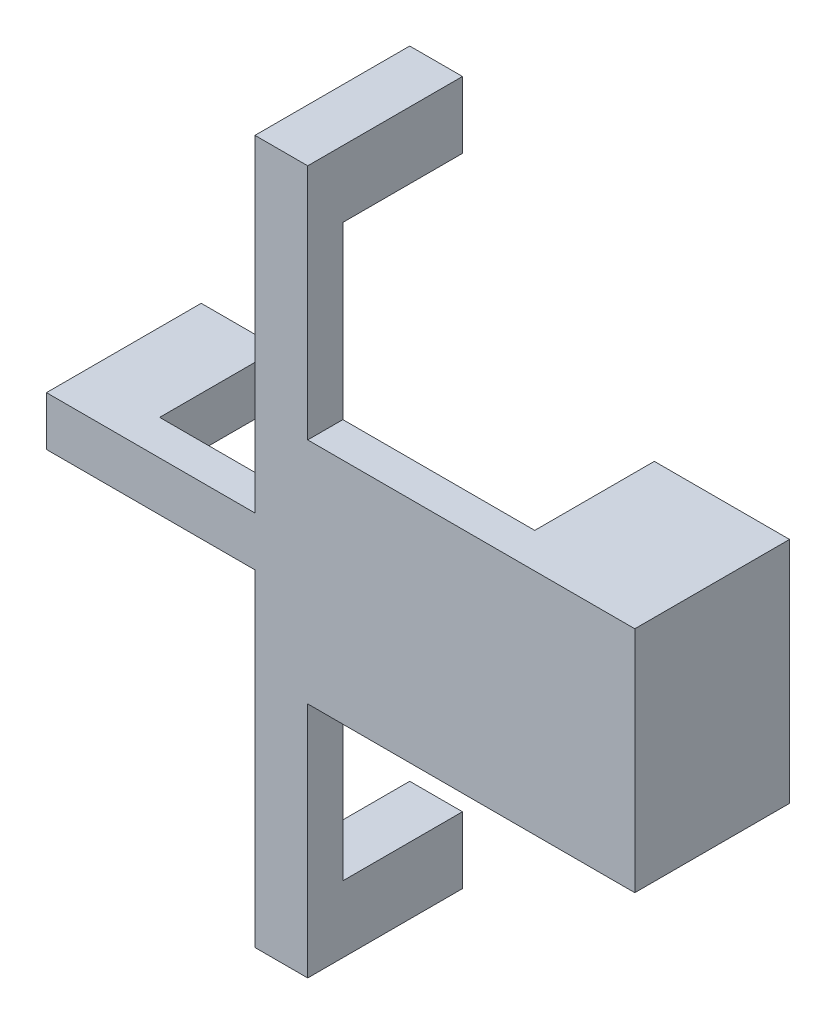
ISO-10303-21;
HEADER;
FILE_DESCRIPTION(('STEP AP214'),'2;1');
FILE_NAME('part.step','',(''),(''),'','','');
FILE_SCHEMA(('AUTOMOTIVE_DESIGN { 1 0 10303 214 1 1 1 1 }'));
ENDSEC;
DATA;
#1=APPLICATION_CONTEXT('core data for automotive mechanical design processes');
#2=APPLICATION_PROTOCOL_DEFINITION('international standard','automotive_design',2000,#1);
#3=PRODUCT_CONTEXT('',#1,'mechanical');
#4=PRODUCT('Part','Part','',(#3));
#5=PRODUCT_RELATED_PRODUCT_CATEGORY('part','',(#4));
#6=PRODUCT_DEFINITION_FORMATION('','',#4);
#7=PRODUCT_DEFINITION_CONTEXT('part definition',#1,'design');
#8=PRODUCT_DEFINITION('design','',#6,#7);
#9=PRODUCT_DEFINITION_SHAPE('','',#8);
#10=(LENGTH_UNIT() NAMED_UNIT(*) SI_UNIT(.MILLI.,.METRE.));
#11=(NAMED_UNIT(*) PLANE_ANGLE_UNIT() SI_UNIT($,.RADIAN.));
#12=(NAMED_UNIT(*) SI_UNIT($,.STERADIAN.) SOLID_ANGLE_UNIT());
#13=UNCERTAINTY_MEASURE_WITH_UNIT(LENGTH_MEASURE(1.E-05),#10,'distance_accuracy_value','');
#14=(GEOMETRIC_REPRESENTATION_CONTEXT(3) GLOBAL_UNCERTAINTY_ASSIGNED_CONTEXT((#13)) GLOBAL_UNIT_ASSIGNED_CONTEXT((#10,
#11,#12)) REPRESENTATION_CONTEXT('',''));
#15=CARTESIAN_POINT('',(0.,0.,0.));
#16=DIRECTION('',(0.,0.,1.));
#17=DIRECTION('',(1.,0.,0.));
#18=AXIS2_PLACEMENT_3D('',#15,#16,#17);
#19=CARTESIAN_POINT('',(-10.4210295985664,-7.9,-8.8));
#20=DIRECTION('',(1.,0.,0.));
#21=DIRECTION('',(0.,0.,-1.));
#22=AXIS2_PLACEMENT_3D('',#19,#20,#21);
#23=PLANE('',#22);
#24=DIRECTION('',(0.,0.,1.));
#25=VECTOR('',#24,1.);
#26=CARTESIAN_POINT('',(-10.4210295985664,-5.10000000000001,-8.8));
#27=LINE('',#26,#25);
#28=CARTESIAN_POINT('',(-10.4210295985664,-5.10000000000001,-8.8));
#29=VERTEX_POINT('',#28);
#30=CARTESIAN_POINT('',(-10.4210295985664,-5.10000000000001,-2.));
#31=VERTEX_POINT('',#30);
#32=EDGE_CURVE('E44',#29,#31,#27,.T.);
#33=ORIENTED_EDGE('',*,*,#32,.T.);
#34=DIRECTION('',(0.,-1.,0.));
#35=VECTOR('',#34,1.);
#36=CARTESIAN_POINT('',(-10.4210295985664,-7.9,-2.));
#37=LINE('',#36,#35);
#38=CARTESIAN_POINT('',(-10.4210295985664,-7.9,-2.));
#39=VERTEX_POINT('',#38);
#40=EDGE_CURVE('E317',#31,#39,#37,.T.);
#41=ORIENTED_EDGE('',*,*,#40,.T.);
#42=DIRECTION('',(0.,0.,1.));
#43=VECTOR('',#42,1.);
#44=CARTESIAN_POINT('',(-10.4210295985664,-7.9,-8.8));
#45=LINE('',#44,#43);
#46=CARTESIAN_POINT('',(-10.4210295985664,-7.9,-8.8));
#47=VERTEX_POINT('',#46);
#48=EDGE_CURVE('E337',#47,#39,#45,.T.);
#49=ORIENTED_EDGE('',*,*,#48,.F.);
#50=DIRECTION('',(0.,1.,0.));
#51=VECTOR('',#50,1.);
#52=CARTESIAN_POINT('',(-10.4210295985664,-7.9,-8.8));
#53=LINE('',#52,#51);
#54=EDGE_CURVE('E325',#47,#29,#53,.T.);
#55=ORIENTED_EDGE('',*,*,#54,.T.);
#56=EDGE_LOOP('',(#33,#41,#49,#55));
#57=FACE_BOUND('',#56,.T.);
#58=ADVANCED_FACE('F35',(#57),#23,.T.);
#59=CARTESIAN_POINT('',(-14.8576651397661,-7.9,-8.8));
#60=DIRECTION('',(-1.,0.,0.));
#61=DIRECTION('',(0.,0.,1.));
#62=AXIS2_PLACEMENT_3D('',#59,#60,#61);
#63=PLANE('',#62);
#64=DIRECTION('',(0.,-1.,0.));
#65=VECTOR('',#64,1.);
#66=CARTESIAN_POINT('',(-14.8576651397661,-7.9,0.));
#67=LINE('',#66,#65);
#68=CARTESIAN_POINT('',(-14.8576651397661,-5.10000000000001,0.));
#69=VERTEX_POINT('',#68);
#70=CARTESIAN_POINT('',(-14.8576651397661,-7.9,0.));
#71=VERTEX_POINT('',#70);
#72=EDGE_CURVE('E319',#69,#71,#67,.T.);
#73=ORIENTED_EDGE('',*,*,#72,.F.);
#74=DIRECTION('',(0.,0.,1.));
#75=VECTOR('',#74,1.);
#76=CARTESIAN_POINT('',(-14.8576651397661,-5.10000000000001,-8.8));
#77=LINE('',#76,#75);
#78=CARTESIAN_POINT('',(-14.8576651397661,-5.10000000000001,-8.8));
#79=VERTEX_POINT('',#78);
#80=EDGE_CURVE('E11',#79,#69,#77,.T.);
#81=ORIENTED_EDGE('',*,*,#80,.F.);
#82=DIRECTION('',(0.,-1.,0.));
#83=VECTOR('',#82,1.);
#84=CARTESIAN_POINT('',(-14.8576651397661,-7.9,-8.8));
#85=LINE('',#84,#83);
#86=CARTESIAN_POINT('',(-14.8576651397661,-7.9,-8.8));
#87=VERTEX_POINT('',#86);
#88=EDGE_CURVE('E320',#79,#87,#85,.T.);
#89=ORIENTED_EDGE('',*,*,#88,.T.);
#90=DIRECTION('',(0.,0.,1.));
#91=VECTOR('',#90,1.);
#92=CARTESIAN_POINT('',(-14.8576651397661,-7.9,-8.8));
#93=LINE('',#92,#91);
#94=EDGE_CURVE('E39',#87,#71,#93,.T.);
#95=ORIENTED_EDGE('',*,*,#94,.T.);
#96=EDGE_LOOP('',(#73,#81,#89,#95));
#97=FACE_BOUND('',#96,.T.);
#98=ADVANCED_FACE('F37',(#97),#63,.T.);
#99=CARTESIAN_POINT('',(-14.8576651397661,-5.10000000000001,-8.8));
#100=DIRECTION('',(0.,1.,0.));
#101=DIRECTION('',(0.,0.,1.));
#102=AXIS2_PLACEMENT_3D('',#99,#100,#101);
#103=PLANE('',#102);
#104=DIRECTION('',(-1.,0.,0.));
#105=VECTOR('',#104,1.);
#106=CARTESIAN_POINT('',(-14.8576651397661,-5.10000000000001,-2.));
#107=LINE('',#106,#105);
#108=CARTESIAN_POINT('',(-3.,-5.10000000000001,-2.));
#109=VERTEX_POINT('',#108);
#110=EDGE_CURVE('E243',#109,#31,#107,.T.);
#111=ORIENTED_EDGE('',*,*,#110,.T.);
#112=ORIENTED_EDGE('',*,*,#32,.F.);
#113=DIRECTION('',(-1.,0.,0.));
#114=VECTOR('',#113,1.);
#115=CARTESIAN_POINT('',(-14.8576651397661,-5.10000000000001,-8.8));
#116=LINE('',#115,#114);
#117=EDGE_CURVE('E328',#29,#79,#116,.T.);
#118=ORIENTED_EDGE('',*,*,#117,.T.);
#119=ORIENTED_EDGE('',*,*,#80,.T.);
#120=DIRECTION('',(-1.,0.,0.));
#121=VECTOR('',#120,1.);
#122=CARTESIAN_POINT('',(-14.8576651397661,-5.10000000000001,0.));
#123=LINE('',#122,#121);
#124=CARTESIAN_POINT('',(-3.,-5.10000000000001,0.));
#125=VERTEX_POINT('',#124);
#126=EDGE_CURVE('E323',#125,#69,#123,.T.);
#127=ORIENTED_EDGE('',*,*,#126,.F.);
#128=DIRECTION('',(0.,0.,1.));
#129=VECTOR('',#128,1.);
#130=CARTESIAN_POINT('',(-3.,-5.10000000000001,-2.));
#131=LINE('',#130,#129);
#132=EDGE_CURVE('E266',#109,#125,#131,.T.);
#133=ORIENTED_EDGE('',*,*,#132,.F.);
#134=EDGE_LOOP('',(#111,#112,#118,#119,#127,#133));
#135=FACE_BOUND('',#134,.T.);
#136=ADVANCED_FACE('F345',(#135),#103,.T.);
#137=CARTESIAN_POINT('',(-14.8576651397661,-7.9,-8.8));
#138=DIRECTION('',(0.,-1.,0.));
#139=DIRECTION('',(0.,0.,-1.));
#140=AXIS2_PLACEMENT_3D('',#137,#138,#139);
#141=PLANE('',#140);
#142=DIRECTION('',(1.,0.,0.));
#143=VECTOR('',#142,1.);
#144=CARTESIAN_POINT('',(-14.8576651397661,-7.9,0.));
#145=LINE('',#144,#143);
#146=CARTESIAN_POINT('',(-3.,-7.9,0.));
#147=VERTEX_POINT('',#146);
#148=EDGE_CURVE('E332',#71,#147,#145,.T.);
#149=ORIENTED_EDGE('',*,*,#148,.F.);
#150=ORIENTED_EDGE('',*,*,#94,.F.);
#151=DIRECTION('',(1.,0.,0.));
#152=VECTOR('',#151,1.);
#153=CARTESIAN_POINT('',(-14.8576651397661,-7.9,-8.8));
#154=LINE('',#153,#152);
#155=EDGE_CURVE('E322',#87,#47,#154,.T.);
#156=ORIENTED_EDGE('',*,*,#155,.T.);
#157=ORIENTED_EDGE('',*,*,#48,.T.);
#158=DIRECTION('',(1.,0.,0.));
#159=VECTOR('',#158,1.);
#160=CARTESIAN_POINT('',(-14.8576651397661,-7.9,-2.));
#161=LINE('',#160,#159);
#162=CARTESIAN_POINT('',(-3.,-7.9,-2.));
#163=VERTEX_POINT('',#162);
#164=EDGE_CURVE('E52',#39,#163,#161,.T.);
#165=ORIENTED_EDGE('',*,*,#164,.T.);
#166=DIRECTION('',(0.,0.,1.));
#167=VECTOR('',#166,1.);
#168=CARTESIAN_POINT('',(-3.,-7.9,-2.));
#169=LINE('',#168,#167);
#170=EDGE_CURVE('E190',#163,#147,#169,.T.);
#171=ORIENTED_EDGE('',*,*,#170,.T.);
#172=EDGE_LOOP('',(#149,#150,#156,#157,#165,#171));
#173=FACE_BOUND('',#172,.T.);
#174=ADVANCED_FACE('F339',(#173),#141,.T.);
#175=CARTESIAN_POINT('',(0.,0.,-8.8));
#176=DIRECTION('',(0.,0.,-1.));
#177=DIRECTION('',(-1.,0.,0.));
#178=AXIS2_PLACEMENT_3D('',#175,#176,#177);
#179=PLANE('',#178);
#180=ORIENTED_EDGE('',*,*,#88,.F.);
#181=ORIENTED_EDGE('',*,*,#117,.F.);
#182=ORIENTED_EDGE('',*,*,#54,.F.);
#183=ORIENTED_EDGE('',*,*,#155,.F.);
#184=EDGE_LOOP('',(#180,#181,#182,#183));
#185=FACE_BOUND('',#184,.T.);
#186=ADVANCED_FACE('F354',(#185),#179,.T.);
#187=CARTESIAN_POINT('',(0.,0.,0.));
#188=DIRECTION('',(0.,0.,-1.));
#189=DIRECTION('',(-1.,0.,0.));
#190=AXIS2_PLACEMENT_3D('',#187,#188,#189);
#191=PLANE('',#190);
#192=ORIENTED_EDGE('',*,*,#72,.T.);
#193=ORIENTED_EDGE('',*,*,#148,.T.);
#194=DIRECTION('',(0.,-1.,0.));
#195=VECTOR('',#194,1.);
#196=CARTESIAN_POINT('',(-3.,-7.9,0.));
#197=LINE('',#196,#195);
#198=CARTESIAN_POINT('',(-3.,-26.5,0.));
#199=VERTEX_POINT('',#198);
#200=EDGE_CURVE('E259',#147,#199,#197,.T.);
#201=ORIENTED_EDGE('',*,*,#200,.T.);
#202=DIRECTION('',(1.,0.,0.));
#203=VECTOR('',#202,1.);
#204=CARTESIAN_POINT('',(-3.,-26.5,0.));
#205=LINE('',#204,#203);
#206=CARTESIAN_POINT('',(0.,-26.5,0.));
#207=VERTEX_POINT('',#206);
#208=EDGE_CURVE('E185',#199,#207,#205,.T.);
#209=ORIENTED_EDGE('',*,*,#208,.T.);
#210=DIRECTION('',(0.,1.,0.));
#211=VECTOR('',#210,1.);
#212=CARTESIAN_POINT('',(0.,-13.,0.));
#213=LINE('',#212,#211);
#214=CARTESIAN_POINT('',(0.,-13.,0.));
#215=VERTEX_POINT('',#214);
#216=EDGE_CURVE('E229',#207,#215,#213,.T.);
#217=ORIENTED_EDGE('',*,*,#216,.T.);
#218=DIRECTION('',(1.,0.,0.));
#219=VECTOR('',#218,1.);
#220=CARTESIAN_POINT('',(10.9105999006382,-13.,0.));
#221=LINE('',#220,#219);
#222=CARTESIAN_POINT('',(18.6,-13.,0.));
#223=VERTEX_POINT('',#222);
#224=EDGE_CURVE('E286',#215,#223,#221,.T.);
#225=ORIENTED_EDGE('',*,*,#224,.T.);
#226=DIRECTION('',(0.,1.,0.));
#227=VECTOR('',#226,1.);
#228=CARTESIAN_POINT('',(18.6,0.,0.));
#229=LINE('',#228,#227);
#230=CARTESIAN_POINT('',(18.6,0.,0.));
#231=VERTEX_POINT('',#230);
#232=EDGE_CURVE('E281',#223,#231,#229,.T.);
#233=ORIENTED_EDGE('',*,*,#232,.T.);
#234=DIRECTION('',(-1.,0.,0.));
#235=VECTOR('',#234,1.);
#236=CARTESIAN_POINT('',(10.9105999006382,0.,0.));
#237=LINE('',#236,#235);
#238=CARTESIAN_POINT('',(0.,0.,0.));
#239=VERTEX_POINT('',#238);
#240=EDGE_CURVE('E298',#231,#239,#237,.T.);
#241=ORIENTED_EDGE('',*,*,#240,.T.);
#242=DIRECTION('',(0.,1.,0.));
#243=VECTOR('',#242,1.);
#244=CARTESIAN_POINT('',(0.,0.,0.));
#245=LINE('',#244,#243);
#246=CARTESIAN_POINT('',(0.,13.5,0.));
#247=VERTEX_POINT('',#246);
#248=EDGE_CURVE('E251',#239,#247,#245,.T.);
#249=ORIENTED_EDGE('',*,*,#248,.T.);
#250=DIRECTION('',(-1.,0.,0.));
#251=VECTOR('',#250,1.);
#252=CARTESIAN_POINT('',(0.,13.5,0.));
#253=LINE('',#252,#251);
#254=CARTESIAN_POINT('',(-3.,13.5,0.));
#255=VERTEX_POINT('',#254);
#256=EDGE_CURVE('E253',#247,#255,#253,.T.);
#257=ORIENTED_EDGE('',*,*,#256,.T.);
#258=DIRECTION('',(0.,-1.,0.));
#259=VECTOR('',#258,1.);
#260=CARTESIAN_POINT('',(-3.,-5.10000000000001,0.));
#261=LINE('',#260,#259);
#262=EDGE_CURVE('E256',#255,#125,#261,.T.);
#263=ORIENTED_EDGE('',*,*,#262,.T.);
#264=ORIENTED_EDGE('',*,*,#126,.T.);
#265=EDGE_LOOP('',(#192,#193,#201,#209,#217,#225,#233,#241,#249,#257,#263,#264));
#266=FACE_BOUND('',#265,.T.);
#267=ADVANCED_FACE('F342',(#266),#191,.F.);
#268=CARTESIAN_POINT('',(10.9105999006382,0.,-8.8));
#269=DIRECTION('',(-1.,0.,0.));
#270=DIRECTION('',(0.,0.,1.));
#271=AXIS2_PLACEMENT_3D('',#268,#269,#270);
#272=PLANE('',#271);
#273=DIRECTION('',(0.,0.,1.));
#274=VECTOR('',#273,1.);
#275=CARTESIAN_POINT('',(10.9105999006382,-13.,-8.8));
#276=LINE('',#275,#274);
#277=CARTESIAN_POINT('',(10.9105999006382,-13.,-8.8));
#278=VERTEX_POINT('',#277);
#279=CARTESIAN_POINT('',(10.9105999006382,-13.,-2.));
#280=VERTEX_POINT('',#279);
#281=EDGE_CURVE('E305',#278,#280,#276,.T.);
#282=ORIENTED_EDGE('',*,*,#281,.T.);
#283=DIRECTION('',(0.,1.,0.));
#284=VECTOR('',#283,1.);
#285=CARTESIAN_POINT('',(10.9105999006382,0.,-2.));
#286=LINE('',#285,#284);
#287=CARTESIAN_POINT('',(10.9105999006382,0.,-2.));
#288=VERTEX_POINT('',#287);
#289=EDGE_CURVE('E262',#280,#288,#286,.T.);
#290=ORIENTED_EDGE('',*,*,#289,.T.);
#291=DIRECTION('',(0.,0.,1.));
#292=VECTOR('',#291,1.);
#293=CARTESIAN_POINT('',(10.9105999006382,0.,-8.8));
#294=LINE('',#293,#292);
#295=CARTESIAN_POINT('',(10.9105999006382,0.,-8.8));
#296=VERTEX_POINT('',#295);
#297=EDGE_CURVE('E308',#296,#288,#294,.T.);
#298=ORIENTED_EDGE('',*,*,#297,.F.);
#299=DIRECTION('',(0.,-1.,0.));
#300=VECTOR('',#299,1.);
#301=CARTESIAN_POINT('',(10.9105999006382,0.,-8.8));
#302=LINE('',#301,#300);
#303=EDGE_CURVE('E289',#296,#278,#302,.T.);
#304=ORIENTED_EDGE('',*,*,#303,.T.);
#305=EDGE_LOOP('',(#282,#290,#298,#304));
#306=FACE_BOUND('',#305,.T.);
#307=ADVANCED_FACE('F361',(#306),#272,.T.);
#308=CARTESIAN_POINT('',(18.6,0.,-8.8));
#309=DIRECTION('',(1.,0.,0.));
#310=DIRECTION('',(0.,1.,0.));
#311=AXIS2_PLACEMENT_3D('',#308,#309,#310);
#312=PLANE('',#311);
#313=ORIENTED_EDGE('',*,*,#232,.F.);
#314=DIRECTION('',(0.,0.,1.));
#315=VECTOR('',#314,1.);
#316=CARTESIAN_POINT('',(18.6,-13.,-8.8));
#317=LINE('',#316,#315);
#318=CARTESIAN_POINT('',(18.6,-13.,-8.8));
#319=VERTEX_POINT('',#318);
#320=EDGE_CURVE('E302',#319,#223,#317,.T.);
#321=ORIENTED_EDGE('',*,*,#320,.F.);
#322=DIRECTION('',(0.,1.,0.));
#323=VECTOR('',#322,1.);
#324=CARTESIAN_POINT('',(18.6,0.,-8.8));
#325=LINE('',#324,#323);
#326=CARTESIAN_POINT('',(18.6,0.,-8.8));
#327=VERTEX_POINT('',#326);
#328=EDGE_CURVE('E282',#319,#327,#325,.T.);
#329=ORIENTED_EDGE('',*,*,#328,.T.);
#330=DIRECTION('',(0.,0.,1.));
#331=VECTOR('',#330,1.);
#332=CARTESIAN_POINT('',(18.6,0.,-8.8));
#333=LINE('',#332,#331);
#334=EDGE_CURVE('E295',#327,#231,#333,.T.);
#335=ORIENTED_EDGE('',*,*,#334,.T.);
#336=EDGE_LOOP('',(#313,#321,#329,#335));
#337=FACE_BOUND('',#336,.T.);
#338=ADVANCED_FACE('F390',(#337),#312,.T.);
#339=CARTESIAN_POINT('',(10.9105999006382,-13.,-8.8));
#340=DIRECTION('',(0.,-1.,0.));
#341=DIRECTION('',(1.,0.,0.));
#342=AXIS2_PLACEMENT_3D('',#339,#340,#341);
#343=PLANE('',#342);
#344=DIRECTION('',(1.,0.,0.));
#345=VECTOR('',#344,1.);
#346=CARTESIAN_POINT('',(0.,-13.,-2.));
#347=LINE('',#346,#345);
#348=CARTESIAN_POINT('',(0.,-13.,-2.));
#349=VERTEX_POINT('',#348);
#350=EDGE_CURVE('E233',#349,#280,#347,.T.);
#351=ORIENTED_EDGE('',*,*,#350,.T.);
#352=ORIENTED_EDGE('',*,*,#281,.F.);
#353=DIRECTION('',(1.,0.,0.));
#354=VECTOR('',#353,1.);
#355=CARTESIAN_POINT('',(10.9105999006382,-13.,-8.8));
#356=LINE('',#355,#354);
#357=EDGE_CURVE('E292',#278,#319,#356,.T.);
#358=ORIENTED_EDGE('',*,*,#357,.T.);
#359=ORIENTED_EDGE('',*,*,#320,.T.);
#360=ORIENTED_EDGE('',*,*,#224,.F.);
#361=DIRECTION('',(0.,0.,1.));
#362=VECTOR('',#361,1.);
#363=CARTESIAN_POINT('',(0.,-13.,-2.));
#364=LINE('',#363,#362);
#365=EDGE_CURVE('E249',#349,#215,#364,.T.);
#366=ORIENTED_EDGE('',*,*,#365,.F.);
#367=EDGE_LOOP('',(#351,#352,#358,#359,#360,#366));
#368=FACE_BOUND('',#367,.T.);
#369=ADVANCED_FACE('F399',(#368),#343,.T.);
#370=CARTESIAN_POINT('',(10.9105999006382,0.,-8.8));
#371=DIRECTION('',(0.,1.,0.));
#372=DIRECTION('',(-1.,0.,0.));
#373=AXIS2_PLACEMENT_3D('',#370,#371,#372);
#374=PLANE('',#373);
#375=ORIENTED_EDGE('',*,*,#240,.F.);
#376=ORIENTED_EDGE('',*,*,#334,.F.);
#377=DIRECTION('',(-1.,0.,0.));
#378=VECTOR('',#377,1.);
#379=CARTESIAN_POINT('',(10.9105999006382,0.,-8.8));
#380=LINE('',#379,#378);
#381=EDGE_CURVE('E285',#327,#296,#380,.T.);
#382=ORIENTED_EDGE('',*,*,#381,.T.);
#383=ORIENTED_EDGE('',*,*,#297,.T.);
#384=DIRECTION('',(-1.,0.,0.));
#385=VECTOR('',#384,1.);
#386=CARTESIAN_POINT('',(0.,0.,-2.));
#387=LINE('',#386,#385);
#388=CARTESIAN_POINT('',(0.,0.,-2.));
#389=VERTEX_POINT('',#388);
#390=EDGE_CURVE('E236',#288,#389,#387,.T.);
#391=ORIENTED_EDGE('',*,*,#390,.T.);
#392=DIRECTION('',(0.,0.,1.));
#393=VECTOR('',#392,1.);
#394=CARTESIAN_POINT('',(0.,0.,-2.));
#395=LINE('',#394,#393);
#396=EDGE_CURVE('E274',#389,#239,#395,.T.);
#397=ORIENTED_EDGE('',*,*,#396,.T.);
#398=EDGE_LOOP('',(#375,#376,#382,#383,#391,#397));
#399=FACE_BOUND('',#398,.T.);
#400=ADVANCED_FACE('F407',(#399),#374,.T.);
#401=CARTESIAN_POINT('',(0.,0.,-8.8));
#402=DIRECTION('',(0.,0.,1.));
#403=DIRECTION('',(1.,0.,0.));
#404=AXIS2_PLACEMENT_3D('',#401,#402,#403);
#405=PLANE('',#404);
#406=ORIENTED_EDGE('',*,*,#328,.F.);
#407=ORIENTED_EDGE('',*,*,#357,.F.);
#408=ORIENTED_EDGE('',*,*,#303,.F.);
#409=ORIENTED_EDGE('',*,*,#381,.F.);
#410=EDGE_LOOP('',(#406,#407,#408,#409));
#411=FACE_BOUND('',#410,.T.);
#412=ADVANCED_FACE('F416',(#411),#405,.F.);
#413=CARTESIAN_POINT('',(0.,-13.,-2.));
#414=DIRECTION('',(1.,0.,0.));
#415=DIRECTION('',(0.,1.,0.));
#416=AXIS2_PLACEMENT_3D('',#413,#414,#415);
#417=PLANE('',#416);
#418=ORIENTED_EDGE('',*,*,#365,.T.);
#419=ORIENTED_EDGE('',*,*,#216,.F.);
#420=DIRECTION('',(0.,0.,1.));
#421=VECTOR('',#420,1.);
#422=CARTESIAN_POINT('',(0.,-26.5,-2.));
#423=LINE('',#422,#421);
#424=CARTESIAN_POINT('',(0.,-26.5,-8.8));
#425=VERTEX_POINT('',#424);
#426=EDGE_CURVE('E189',#425,#207,#423,.T.);
#427=ORIENTED_EDGE('',*,*,#426,.F.);
#428=DIRECTION('',(0.,1.,0.));
#429=VECTOR('',#428,1.);
#430=CARTESIAN_POINT('',(0.,-26.5,-8.8));
#431=LINE('',#430,#429);
#432=CARTESIAN_POINT('',(0.,-22.7115284750964,-8.8));
#433=VERTEX_POINT('',#432);
#434=EDGE_CURVE('E200',#425,#433,#431,.T.);
#435=ORIENTED_EDGE('',*,*,#434,.T.);
#436=DIRECTION('',(0.,0.,1.));
#437=VECTOR('',#436,1.);
#438=CARTESIAN_POINT('',(0.,-22.7115284750964,-8.8));
#439=LINE('',#438,#437);
#440=CARTESIAN_POINT('',(0.,-22.7115284750964,-2.));
#441=VERTEX_POINT('',#440);
#442=EDGE_CURVE('E210',#433,#441,#439,.T.);
#443=ORIENTED_EDGE('',*,*,#442,.T.);
#444=DIRECTION('',(0.,1.,0.));
#445=VECTOR('',#444,1.);
#446=CARTESIAN_POINT('',(0.,-13.,-2.));
#447=LINE('',#446,#445);
#448=EDGE_CURVE('E231',#441,#349,#447,.T.);
#449=ORIENTED_EDGE('',*,*,#448,.T.);
#450=EDGE_LOOP('',(#418,#419,#427,#435,#443,#449));
#451=FACE_BOUND('',#450,.T.);
#452=ADVANCED_FACE('F425',(#451),#417,.T.);
#453=CARTESIAN_POINT('',(-3.,-26.5,-2.));
#454=DIRECTION('',(0.,-1.,0.));
#455=DIRECTION('',(0.,0.,-1.));
#456=AXIS2_PLACEMENT_3D('',#453,#454,#455);
#457=PLANE('',#456);
#458=ORIENTED_EDGE('',*,*,#208,.F.);
#459=DIRECTION('',(0.,0.,1.));
#460=VECTOR('',#459,1.);
#461=CARTESIAN_POINT('',(-3.,-26.5,-2.));
#462=LINE('',#461,#460);
#463=CARTESIAN_POINT('',(-3.,-26.5,-8.8));
#464=VERTEX_POINT('',#463);
#465=EDGE_CURVE('E180',#464,#199,#462,.T.);
#466=ORIENTED_EDGE('',*,*,#465,.F.);
#467=DIRECTION('',(1.,0.,0.));
#468=VECTOR('',#467,1.);
#469=CARTESIAN_POINT('',(-3.,-26.5,-8.8));
#470=LINE('',#469,#468);
#471=EDGE_CURVE('E183',#464,#425,#470,.T.);
#472=ORIENTED_EDGE('',*,*,#471,.T.);
#473=ORIENTED_EDGE('',*,*,#426,.T.);
#474=EDGE_LOOP('',(#458,#466,#472,#473));
#475=FACE_BOUND('',#474,.T.);
#476=ADVANCED_FACE('F182',(#475),#457,.T.);
#477=CARTESIAN_POINT('',(-3.,-7.9,-2.));
#478=DIRECTION('',(-1.,0.,0.));
#479=DIRECTION('',(0.,-1.,0.));
#480=AXIS2_PLACEMENT_3D('',#477,#478,#479);
#481=PLANE('',#480);
#482=DIRECTION('',(0.,-1.,0.));
#483=VECTOR('',#482,1.);
#484=CARTESIAN_POINT('',(-3.,-7.9,-2.));
#485=LINE('',#484,#483);
#486=CARTESIAN_POINT('',(-3.,-22.7115284750964,-2.));
#487=VERTEX_POINT('',#486);
#488=EDGE_CURVE('E247',#163,#487,#485,.T.);
#489=ORIENTED_EDGE('',*,*,#488,.T.);
#490=DIRECTION('',(0.,0.,1.));
#491=VECTOR('',#490,1.);
#492=CARTESIAN_POINT('',(-3.,-22.7115284750964,-8.8));
#493=LINE('',#492,#491);
#494=CARTESIAN_POINT('',(-3.,-22.7115284750964,-8.8));
#495=VERTEX_POINT('',#494);
#496=EDGE_CURVE('E204',#495,#487,#493,.T.);
#497=ORIENTED_EDGE('',*,*,#496,.F.);
#498=DIRECTION('',(0.,-1.,0.));
#499=VECTOR('',#498,1.);
#500=CARTESIAN_POINT('',(-3.,-22.7115284750964,-8.8));
#501=LINE('',#500,#499);
#502=EDGE_CURVE('E197',#495,#464,#501,.T.);
#503=ORIENTED_EDGE('',*,*,#502,.T.);
#504=ORIENTED_EDGE('',*,*,#465,.T.);
#505=ORIENTED_EDGE('',*,*,#200,.F.);
#506=ORIENTED_EDGE('',*,*,#170,.F.);
#507=EDGE_LOOP('',(#489,#497,#503,#504,#505,#506));
#508=FACE_BOUND('',#507,.T.);
#509=ADVANCED_FACE('F203',(#508),#481,.T.);
#510=CARTESIAN_POINT('',(-3.,-5.10000000000001,-2.));
#511=DIRECTION('',(-1.,0.,0.));
#512=DIRECTION('',(0.,-1.,0.));
#513=AXIS2_PLACEMENT_3D('',#510,#511,#512);
#514=PLANE('',#513);
#515=ORIENTED_EDGE('',*,*,#132,.T.);
#516=ORIENTED_EDGE('',*,*,#262,.F.);
#517=DIRECTION('',(0.,0.,1.));
#518=VECTOR('',#517,1.);
#519=CARTESIAN_POINT('',(-3.,13.5,-2.));
#520=LINE('',#519,#518);
#521=CARTESIAN_POINT('',(-3.,13.5,-8.8));
#522=VERTEX_POINT('',#521);
#523=EDGE_CURVE('E269',#522,#255,#520,.T.);
#524=ORIENTED_EDGE('',*,*,#523,.F.);
#525=DIRECTION('',(0.,-1.,0.));
#526=VECTOR('',#525,1.);
#527=CARTESIAN_POINT('',(-3.,9.71152847509643,-8.8));
#528=LINE('',#527,#526);
#529=CARTESIAN_POINT('',(-3.,9.71152847509643,-8.8));
#530=VERTEX_POINT('',#529);
#531=EDGE_CURVE('E217',#522,#530,#528,.T.);
#532=ORIENTED_EDGE('',*,*,#531,.T.);
#533=DIRECTION('',(0.,0.,1.));
#534=VECTOR('',#533,1.);
#535=CARTESIAN_POINT('',(-3.,9.71152847509643,-8.8));
#536=LINE('',#535,#534);
#537=CARTESIAN_POINT('',(-3.,9.71152847509643,-2.));
#538=VERTEX_POINT('',#537);
#539=EDGE_CURVE('E226',#530,#538,#536,.T.);
#540=ORIENTED_EDGE('',*,*,#539,.T.);
#541=DIRECTION('',(0.,-1.,0.));
#542=VECTOR('',#541,1.);
#543=CARTESIAN_POINT('',(-3.,-5.10000000000001,-2.));
#544=LINE('',#543,#542);
#545=EDGE_CURVE('E241',#538,#109,#544,.T.);
#546=ORIENTED_EDGE('',*,*,#545,.T.);
#547=EDGE_LOOP('',(#515,#516,#524,#532,#540,#546));
#548=FACE_BOUND('',#547,.T.);
#549=ADVANCED_FACE('F449',(#548),#514,.T.);
#550=CARTESIAN_POINT('',(0.,13.5,-2.));
#551=DIRECTION('',(0.,1.,0.));
#552=DIRECTION('',(0.,0.,1.));
#553=AXIS2_PLACEMENT_3D('',#550,#551,#552);
#554=PLANE('',#553);
#555=ORIENTED_EDGE('',*,*,#256,.F.);
#556=DIRECTION('',(0.,0.,1.));
#557=VECTOR('',#556,1.);
#558=CARTESIAN_POINT('',(0.,13.5,-2.));
#559=LINE('',#558,#557);
#560=CARTESIAN_POINT('',(0.,13.5,-8.8));
#561=VERTEX_POINT('',#560);
#562=EDGE_CURVE('E271',#561,#247,#559,.T.);
#563=ORIENTED_EDGE('',*,*,#562,.F.);
#564=DIRECTION('',(-1.,0.,0.));
#565=VECTOR('',#564,1.);
#566=CARTESIAN_POINT('',(-3.,13.5,-8.8));
#567=LINE('',#566,#565);
#568=EDGE_CURVE('E212',#561,#522,#567,.T.);
#569=ORIENTED_EDGE('',*,*,#568,.T.);
#570=ORIENTED_EDGE('',*,*,#523,.T.);
#571=EDGE_LOOP('',(#555,#563,#569,#570));
#572=FACE_BOUND('',#571,.T.);
#573=ADVANCED_FACE('F457',(#572),#554,.T.);
#574=CARTESIAN_POINT('',(0.,0.,-2.));
#575=DIRECTION('',(1.,0.,0.));
#576=DIRECTION('',(0.,1.,0.));
#577=AXIS2_PLACEMENT_3D('',#574,#575,#576);
#578=PLANE('',#577);
#579=DIRECTION('',(0.,1.,0.));
#580=VECTOR('',#579,1.);
#581=CARTESIAN_POINT('',(0.,0.,-2.));
#582=LINE('',#581,#580);
#583=CARTESIAN_POINT('',(0.,9.71152847509643,-2.));
#584=VERTEX_POINT('',#583);
#585=EDGE_CURVE('E238',#389,#584,#582,.T.);
#586=ORIENTED_EDGE('',*,*,#585,.T.);
#587=DIRECTION('',(0.,0.,1.));
#588=VECTOR('',#587,1.);
#589=CARTESIAN_POINT('',(0.,9.71152847509643,-8.8));
#590=LINE('',#589,#588);
#591=CARTESIAN_POINT('',(0.,9.71152847509643,-8.8));
#592=VERTEX_POINT('',#591);
#593=EDGE_CURVE('E227',#592,#584,#590,.T.);
#594=ORIENTED_EDGE('',*,*,#593,.F.);
#595=DIRECTION('',(0.,1.,0.));
#596=VECTOR('',#595,1.);
#597=CARTESIAN_POINT('',(0.,13.5,-8.8));
#598=LINE('',#597,#596);
#599=EDGE_CURVE('E223',#592,#561,#598,.T.);
#600=ORIENTED_EDGE('',*,*,#599,.T.);
#601=ORIENTED_EDGE('',*,*,#562,.T.);
#602=ORIENTED_EDGE('',*,*,#248,.F.);
#603=ORIENTED_EDGE('',*,*,#396,.F.);
#604=EDGE_LOOP('',(#586,#594,#600,#601,#602,#603));
#605=FACE_BOUND('',#604,.T.);
#606=ADVANCED_FACE('F465',(#605),#578,.T.);
#607=CARTESIAN_POINT('',(0.,0.,-2.));
#608=DIRECTION('',(0.,0.,1.));
#609=DIRECTION('',(1.,0.,0.));
#610=AXIS2_PLACEMENT_3D('',#607,#608,#609);
#611=PLANE('',#610);
#612=ORIENTED_EDGE('',*,*,#40,.F.);
#613=ORIENTED_EDGE('',*,*,#110,.F.);
#614=ORIENTED_EDGE('',*,*,#545,.F.);
#615=DIRECTION('',(1.,0.,0.));
#616=VECTOR('',#615,1.);
#617=CARTESIAN_POINT('',(0.,9.71152847509643,-2.));
#618=LINE('',#617,#616);
#619=EDGE_CURVE('E304',#538,#584,#618,.T.);
#620=ORIENTED_EDGE('',*,*,#619,.T.);
#621=ORIENTED_EDGE('',*,*,#585,.F.);
#622=ORIENTED_EDGE('',*,*,#390,.F.);
#623=ORIENTED_EDGE('',*,*,#289,.F.);
#624=ORIENTED_EDGE('',*,*,#350,.F.);
#625=ORIENTED_EDGE('',*,*,#448,.F.);
#626=DIRECTION('',(-1.,0.,0.));
#627=VECTOR('',#626,1.);
#628=CARTESIAN_POINT('',(0.,-22.7115284750964,-2.));
#629=LINE('',#628,#627);
#630=EDGE_CURVE('E314',#441,#487,#629,.T.);
#631=ORIENTED_EDGE('',*,*,#630,.T.);
#632=ORIENTED_EDGE('',*,*,#488,.F.);
#633=ORIENTED_EDGE('',*,*,#164,.F.);
#634=EDGE_LOOP('',(#612,#613,#614,#620,#621,#622,#623,#624,#625,#631,#632,#633));
#635=FACE_BOUND('',#634,.T.);
#636=ADVANCED_FACE('F349',(#635),#611,.F.);
#637=CARTESIAN_POINT('',(-3.,9.71152847509643,-8.8));
#638=DIRECTION('',(0.,-1.,0.));
#639=DIRECTION('',(0.,0.,-1.));
#640=AXIS2_PLACEMENT_3D('',#637,#638,#639);
#641=PLANE('',#640);
#642=ORIENTED_EDGE('',*,*,#619,.F.);
#643=ORIENTED_EDGE('',*,*,#539,.F.);
#644=DIRECTION('',(1.,0.,0.));
#645=VECTOR('',#644,1.);
#646=CARTESIAN_POINT('',(-3.,9.71152847509643,-8.8));
#647=LINE('',#646,#645);
#648=EDGE_CURVE('E220',#530,#592,#647,.T.);
#649=ORIENTED_EDGE('',*,*,#648,.T.);
#650=ORIENTED_EDGE('',*,*,#593,.T.);
#651=EDGE_LOOP('',(#642,#643,#649,#650));
#652=FACE_BOUND('',#651,.T.);
#653=ADVANCED_FACE('F482',(#652),#641,.T.);
#654=CARTESIAN_POINT('',(0.,0.,-8.8));
#655=DIRECTION('',(0.,0.,-1.));
#656=DIRECTION('',(-1.,0.,0.));
#657=AXIS2_PLACEMENT_3D('',#654,#655,#656);
#658=PLANE('',#657);
#659=ORIENTED_EDGE('',*,*,#568,.F.);
#660=ORIENTED_EDGE('',*,*,#599,.F.);
#661=ORIENTED_EDGE('',*,*,#648,.F.);
#662=ORIENTED_EDGE('',*,*,#531,.F.);
#663=EDGE_LOOP('',(#659,#660,#661,#662));
#664=FACE_BOUND('',#663,.T.);
#665=ADVANCED_FACE('F490',(#664),#658,.T.);
#666=CARTESIAN_POINT('',(-3.,-22.7115284750964,-8.8));
#667=DIRECTION('',(0.,1.,0.));
#668=DIRECTION('',(0.,0.,1.));
#669=AXIS2_PLACEMENT_3D('',#666,#667,#668);
#670=PLANE('',#669);
#671=ORIENTED_EDGE('',*,*,#630,.F.);
#672=ORIENTED_EDGE('',*,*,#442,.F.);
#673=DIRECTION('',(-1.,0.,0.));
#674=VECTOR('',#673,1.);
#675=CARTESIAN_POINT('',(-3.,-22.7115284750964,-8.8));
#676=LINE('',#675,#674);
#677=EDGE_CURVE('E208',#433,#495,#676,.T.);
#678=ORIENTED_EDGE('',*,*,#677,.T.);
#679=ORIENTED_EDGE('',*,*,#496,.T.);
#680=EDGE_LOOP('',(#671,#672,#678,#679));
#681=FACE_BOUND('',#680,.T.);
#682=ADVANCED_FACE('F499',(#681),#670,.T.);
#683=CARTESIAN_POINT('',(0.,0.,-8.8));
#684=DIRECTION('',(0.,0.,1.));
#685=DIRECTION('',(1.,0.,0.));
#686=AXIS2_PLACEMENT_3D('',#683,#684,#685);
#687=PLANE('',#686);
#688=ORIENTED_EDGE('',*,*,#502,.F.);
#689=ORIENTED_EDGE('',*,*,#677,.F.);
#690=ORIENTED_EDGE('',*,*,#434,.F.);
#691=ORIENTED_EDGE('',*,*,#471,.F.);
#692=EDGE_LOOP('',(#688,#689,#690,#691));
#693=FACE_BOUND('',#692,.T.);
#694=ADVANCED_FACE('F195',(#693),#687,.F.);
#695=CLOSED_SHELL('',(#58,#98,#136,#174,#186,#267,#307,#338,#369,#400,#412,#452,#476,#509,#549,
#573,#606,#636,#653,#665,#682,#694));
#696=MANIFOLD_SOLID_BREP('B2',#695);
#697=ADVANCED_BREP_SHAPE_REPRESENTATION('',(#18,#696),#14);
#698=SHAPE_DEFINITION_REPRESENTATION(#9,#697);
ENDSEC;
END-ISO-10303-21;
